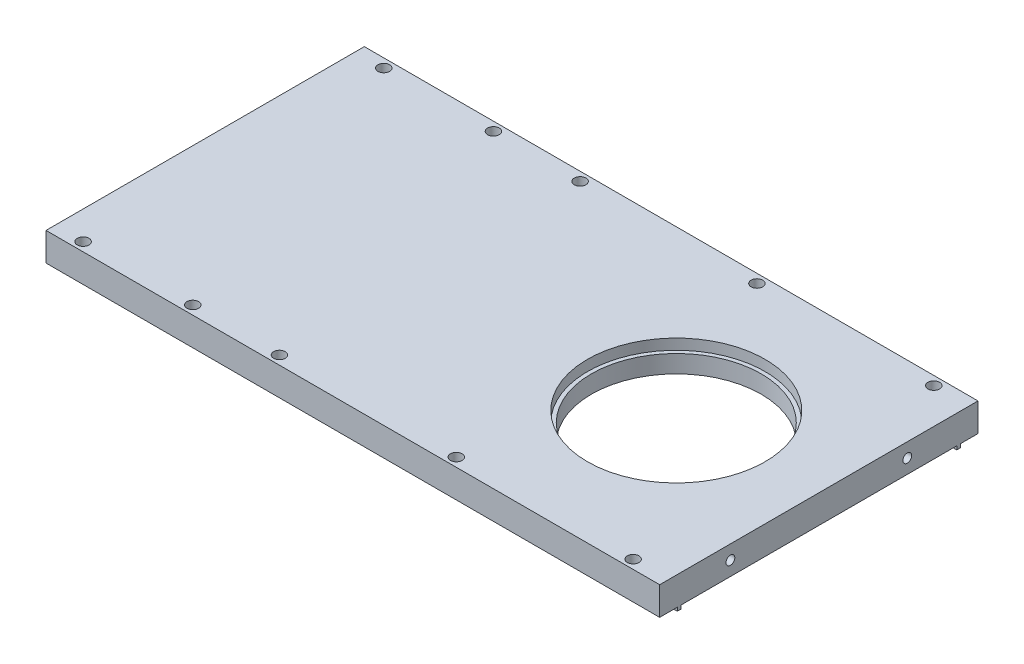
ISO-10303-21;
HEADER;
FILE_DESCRIPTION(('STEP AP214'),'2;1');
FILE_NAME('part.step','',(''),(''),'','','');
FILE_SCHEMA(('AUTOMOTIVE_DESIGN { 1 0 10303 214 1 1 1 1 }'));
ENDSEC;
DATA;
#1=APPLICATION_CONTEXT('core data for automotive mechanical design processes');
#2=APPLICATION_PROTOCOL_DEFINITION('international standard','automotive_design',2000,#1);
#3=PRODUCT_CONTEXT('',#1,'mechanical');
#4=PRODUCT('Part','Part','',(#3));
#5=PRODUCT_RELATED_PRODUCT_CATEGORY('part','',(#4));
#6=PRODUCT_DEFINITION_FORMATION('','',#4);
#7=PRODUCT_DEFINITION_CONTEXT('part definition',#1,'design');
#8=PRODUCT_DEFINITION('design','',#6,#7);
#9=PRODUCT_DEFINITION_SHAPE('','',#8);
#10=(LENGTH_UNIT() NAMED_UNIT(*) SI_UNIT(.MILLI.,.METRE.));
#11=(NAMED_UNIT(*) PLANE_ANGLE_UNIT() SI_UNIT($,.RADIAN.));
#12=(NAMED_UNIT(*) SI_UNIT($,.STERADIAN.) SOLID_ANGLE_UNIT());
#13=UNCERTAINTY_MEASURE_WITH_UNIT(LENGTH_MEASURE(1.E-05),#10,'distance_accuracy_value','');
#14=(GEOMETRIC_REPRESENTATION_CONTEXT(3) GLOBAL_UNCERTAINTY_ASSIGNED_CONTEXT((#13)) GLOBAL_UNIT_ASSIGNED_CONTEXT((#10,
#11,#12)) REPRESENTATION_CONTEXT('',''));
#15=CARTESIAN_POINT('',(0.,0.,0.));
#16=DIRECTION('',(0.,0.,1.));
#17=DIRECTION('',(1.,0.,0.));
#18=AXIS2_PLACEMENT_3D('',#15,#16,#17);
#19=CARTESIAN_POINT('',(217.,-22.,90.));
#20=DIRECTION('',(0.,1.,0.));
#21=DIRECTION('',(-1.,0.,0.));
#22=AXIS2_PLACEMENT_3D('',#19,#20,#21);
#23=PLANE('',#22);
#24=CARTESIAN_POINT('',(157.,-22.,2.5));
#25=DIRECTION('',(0.,1.,0.));
#26=DIRECTION('',(-1.,0.,0.));
#27=AXIS2_PLACEMENT_3D('',#24,#25,#26);
#28=CIRCLE('',#27,1.65000000000002);
#29=CARTESIAN_POINT('',(155.35,-22.,2.5));
#30=VERTEX_POINT('',#29);
#31=EDGE_CURVE('E218',#30,#30,#28,.T.);
#32=ORIENTED_EDGE('',*,*,#31,.T.);
#33=EDGE_LOOP('',(#32));
#34=FACE_BOUND('',#33,.T.);
#35=CARTESIAN_POINT('',(107.,-22.,2.5));
#36=DIRECTION('',(0.,1.,0.));
#37=DIRECTION('',(-1.,0.,0.));
#38=AXIS2_PLACEMENT_3D('',#35,#36,#37);
#39=CIRCLE('',#38,1.65);
#40=CARTESIAN_POINT('',(105.35,-22.,2.5));
#41=VERTEX_POINT('',#40);
#42=EDGE_CURVE('E215',#41,#41,#39,.T.);
#43=ORIENTED_EDGE('',*,*,#42,.T.);
#44=EDGE_LOOP('',(#43));
#45=FACE_BOUND('',#44,.T.);
#46=CARTESIAN_POINT('',(207.,-22.,87.5));
#47=DIRECTION('',(0.,1.,0.));
#48=DIRECTION('',(-1.,0.,0.));
#49=AXIS2_PLACEMENT_3D('',#46,#47,#48);
#50=CIRCLE('',#49,1.65000000000002);
#51=CARTESIAN_POINT('',(205.35,-22.,87.5));
#52=VERTEX_POINT('',#51);
#53=EDGE_CURVE('E212',#52,#52,#50,.T.);
#54=ORIENTED_EDGE('',*,*,#53,.T.);
#55=EDGE_LOOP('',(#54));
#56=FACE_BOUND('',#55,.T.);
#57=CARTESIAN_POINT('',(157.,-22.,87.5));
#58=DIRECTION('',(0.,1.,0.));
#59=DIRECTION('',(-1.,0.,0.));
#60=AXIS2_PLACEMENT_3D('',#57,#58,#59);
#61=CIRCLE('',#60,1.65000000000002);
#62=CARTESIAN_POINT('',(155.35,-22.,87.5));
#63=VERTEX_POINT('',#62);
#64=EDGE_CURVE('E208',#63,#63,#61,.T.);
#65=ORIENTED_EDGE('',*,*,#64,.T.);
#66=EDGE_LOOP('',(#65));
#67=FACE_BOUND('',#66,.T.);
#68=CARTESIAN_POINT('',(82.5,-22.,2.5));
#69=DIRECTION('',(0.,1.,0.));
#70=DIRECTION('',(-1.,0.,0.));
#71=AXIS2_PLACEMENT_3D('',#68,#69,#70);
#72=CIRCLE('',#71,1.65);
#73=CARTESIAN_POINT('',(80.85,-22.,2.5));
#74=VERTEX_POINT('',#73);
#75=EDGE_CURVE('E204',#74,#74,#72,.T.);
#76=ORIENTED_EDGE('',*,*,#75,.T.);
#77=EDGE_LOOP('',(#76));
#78=FACE_BOUND('',#77,.T.);
#79=CARTESIAN_POINT('',(51.5,-22.,87.5));
#80=DIRECTION('',(0.,1.,0.));
#81=DIRECTION('',(-1.,0.,0.));
#82=AXIS2_PLACEMENT_3D('',#79,#80,#81);
#83=CIRCLE('',#82,1.65);
#84=CARTESIAN_POINT('',(49.85,-22.,87.5));
#85=VERTEX_POINT('',#84);
#86=EDGE_CURVE('E233',#85,#85,#83,.T.);
#87=ORIENTED_EDGE('',*,*,#86,.T.);
#88=EDGE_LOOP('',(#87));
#89=FACE_BOUND('',#88,.T.);
#90=CARTESIAN_POINT('',(82.5,-22.,87.5));
#91=DIRECTION('',(0.,1.,0.));
#92=DIRECTION('',(-1.,0.,0.));
#93=AXIS2_PLACEMENT_3D('',#90,#91,#92);
#94=CIRCLE('',#93,1.65);
#95=CARTESIAN_POINT('',(80.85,-22.,87.5));
#96=VERTEX_POINT('',#95);
#97=EDGE_CURVE('E200',#96,#96,#94,.T.);
#98=ORIENTED_EDGE('',*,*,#97,.T.);
#99=EDGE_LOOP('',(#98));
#100=FACE_BOUND('',#99,.T.);
#101=CARTESIAN_POINT('',(107.,-22.,87.5));
#102=DIRECTION('',(0.,1.,0.));
#103=DIRECTION('',(-1.,0.,0.));
#104=AXIS2_PLACEMENT_3D('',#101,#102,#103);
#105=CIRCLE('',#104,1.65);
#106=CARTESIAN_POINT('',(105.35,-22.,87.5));
#107=VERTEX_POINT('',#106);
#108=EDGE_CURVE('E196',#107,#107,#105,.T.);
#109=ORIENTED_EDGE('',*,*,#108,.T.);
#110=EDGE_LOOP('',(#109));
#111=FACE_BOUND('',#110,.T.);
#112=CARTESIAN_POINT('',(207.,-22.,2.5));
#113=DIRECTION('',(0.,1.,0.));
#114=DIRECTION('',(-1.,0.,0.));
#115=AXIS2_PLACEMENT_3D('',#112,#113,#114);
#116=CIRCLE('',#115,1.65000000000002);
#117=CARTESIAN_POINT('',(205.35,-22.,2.5));
#118=VERTEX_POINT('',#117);
#119=EDGE_CURVE('E191',#118,#118,#116,.T.);
#120=ORIENTED_EDGE('',*,*,#119,.T.);
#121=EDGE_LOOP('',(#120));
#122=FACE_BOUND('',#121,.T.);
#123=CARTESIAN_POINT('',(51.5,-22.,2.5));
#124=DIRECTION('',(0.,1.,0.));
#125=DIRECTION('',(-1.,0.,0.));
#126=AXIS2_PLACEMENT_3D('',#123,#124,#125);
#127=CIRCLE('',#126,1.65);
#128=CARTESIAN_POINT('',(49.85,-22.,2.5));
#129=VERTEX_POINT('',#128);
#130=EDGE_CURVE('E222',#129,#129,#127,.T.);
#131=ORIENTED_EDGE('',*,*,#130,.T.);
#132=EDGE_LOOP('',(#131));
#133=FACE_BOUND('',#132,.T.);
#134=CARTESIAN_POINT('',(176.7,-22.,45.));
#135=DIRECTION('',(0.,1.,0.));
#136=DIRECTION('',(0.,0.,1.));
#137=AXIS2_PLACEMENT_3D('',#134,#135,#136);
#138=CIRCLE('',#137,24.);
#139=CARTESIAN_POINT('',(176.7,-22.,68.9999999999999));
#140=VERTEX_POINT('',#139);
#141=EDGE_CURVE('E169',#140,#140,#138,.T.);
#142=ORIENTED_EDGE('',*,*,#141,.T.);
#143=EDGE_LOOP('',(#142));
#144=FACE_BOUND('',#143,.T.);
#145=DIRECTION('',(1.,0.,0.));
#146=VECTOR('',#145,1.);
#147=CARTESIAN_POINT('',(73.5,-22.,5.));
#148=LINE('',#147,#146);
#149=CARTESIAN_POINT('',(73.5,-22.,5.));
#150=VERTEX_POINT('',#149);
#151=CARTESIAN_POINT('',(217.,-22.,5.00000000000003));
#152=VERTEX_POINT('',#151);
#153=EDGE_CURVE('E250',#150,#152,#148,.T.);
#154=ORIENTED_EDGE('',*,*,#153,.F.);
#155=DIRECTION('',(0.,0.,-1.));
#156=VECTOR('',#155,1.);
#157=CARTESIAN_POINT('',(73.5,-22.,6.));
#158=LINE('',#157,#156);
#159=CARTESIAN_POINT('',(73.5,-22.,6.));
#160=VERTEX_POINT('',#159);
#161=EDGE_CURVE('E236',#160,#150,#158,.T.);
#162=ORIENTED_EDGE('',*,*,#161,.F.);
#163=DIRECTION('',(-1.,0.,0.));
#164=VECTOR('',#163,1.);
#165=CARTESIAN_POINT('',(73.5,-22.,6.));
#166=LINE('',#165,#164);
#167=CARTESIAN_POINT('',(217.,-22.,6.));
#168=VERTEX_POINT('',#167);
#169=EDGE_CURVE('E241',#168,#160,#166,.T.);
#170=ORIENTED_EDGE('',*,*,#169,.F.);
#171=DIRECTION('',(0.,0.,-1.));
#172=VECTOR('',#171,1.);
#173=CARTESIAN_POINT('',(217.,-22.,90.));
#174=LINE('',#173,#172);
#175=CARTESIAN_POINT('',(217.,-22.,84.));
#176=VERTEX_POINT('',#175);
#177=EDGE_CURVE('E182',#176,#168,#174,.T.);
#178=ORIENTED_EDGE('',*,*,#177,.F.);
#179=DIRECTION('',(1.,0.,0.));
#180=VECTOR('',#179,1.);
#181=CARTESIAN_POINT('',(73.5,-22.,84.));
#182=LINE('',#181,#180);
#183=CARTESIAN_POINT('',(73.5,-22.,84.));
#184=VERTEX_POINT('',#183);
#185=EDGE_CURVE('E272',#184,#176,#182,.T.);
#186=ORIENTED_EDGE('',*,*,#185,.F.);
#187=DIRECTION('',(0.,0.,-1.));
#188=VECTOR('',#187,1.);
#189=CARTESIAN_POINT('',(73.5,-22.,84.));
#190=LINE('',#189,#188);
#191=CARTESIAN_POINT('',(73.5,-22.,85.));
#192=VERTEX_POINT('',#191);
#193=EDGE_CURVE('E66',#192,#184,#190,.T.);
#194=ORIENTED_EDGE('',*,*,#193,.F.);
#195=DIRECTION('',(-1.,0.,0.));
#196=VECTOR('',#195,1.);
#197=CARTESIAN_POINT('',(73.5,-22.,85.));
#198=LINE('',#197,#196);
#199=CARTESIAN_POINT('',(217.,-22.,85.));
#200=VERTEX_POINT('',#199);
#201=EDGE_CURVE('E264',#200,#192,#198,.T.);
#202=ORIENTED_EDGE('',*,*,#201,.F.);
#203=CARTESIAN_POINT('',(217.,-22.,90.));
#204=VERTEX_POINT('',#203);
#205=EDGE_CURVE('E50',#204,#200,#174,.T.);
#206=ORIENTED_EDGE('',*,*,#205,.F.);
#207=DIRECTION('',(1.,0.,0.));
#208=VECTOR('',#207,1.);
#209=CARTESIAN_POINT('',(217.,-22.,90.));
#210=LINE('',#209,#208);
#211=CARTESIAN_POINT('',(43.5,-22.,90.));
#212=VERTEX_POINT('',#211);
#213=EDGE_CURVE('E163',#212,#204,#210,.T.);
#214=ORIENTED_EDGE('',*,*,#213,.F.);
#215=DIRECTION('',(0.,0.,-1.));
#216=VECTOR('',#215,1.);
#217=CARTESIAN_POINT('',(43.5,-22.,90.));
#218=LINE('',#217,#216);
#219=CARTESIAN_POINT('',(43.5,-22.,0.));
#220=VERTEX_POINT('',#219);
#221=EDGE_CURVE('E11',#212,#220,#218,.T.);
#222=ORIENTED_EDGE('',*,*,#221,.T.);
#223=DIRECTION('',(1.,0.,0.));
#224=VECTOR('',#223,1.);
#225=CARTESIAN_POINT('',(217.,-22.,0.));
#226=LINE('',#225,#224);
#227=CARTESIAN_POINT('',(217.,-22.,0.));
#228=VERTEX_POINT('',#227);
#229=EDGE_CURVE('E175',#220,#228,#226,.T.);
#230=ORIENTED_EDGE('',*,*,#229,.T.);
#231=EDGE_CURVE('E180',#152,#228,#174,.T.);
#232=ORIENTED_EDGE('',*,*,#231,.F.);
#233=EDGE_LOOP('',(#154,#162,#170,#178,#186,#194,#202,#206,#214,#222,#230,#232));
#234=FACE_BOUND('',#233,.T.);
#235=ADVANCED_FACE('F41',(#34,#45,#56,#67,#78,#89,#100,#111,#122,#133,#144,#234),#23,.F.);
#236=CARTESIAN_POINT('',(176.7,-22.,45.));
#237=DIRECTION('',(0.,1.,0.));
#238=DIRECTION('',(0.,0.,1.));
#239=AXIS2_PLACEMENT_3D('',#236,#237,#238);
#240=CYLINDRICAL_SURFACE('',#239,24.);
#241=ORIENTED_EDGE('',*,*,#141,.F.);
#242=EDGE_LOOP('',(#241));
#243=FACE_BOUND('',#242,.T.);
#244=CARTESIAN_POINT('',(176.7,-17.,45.));
#245=DIRECTION('',(0.,1.,0.));
#246=DIRECTION('',(0.,0.,1.));
#247=AXIS2_PLACEMENT_3D('',#244,#245,#246);
#248=CIRCLE('',#247,24.);
#249=CARTESIAN_POINT('',(176.7,-17.,68.9999999999999));
#250=VERTEX_POINT('',#249);
#251=EDGE_CURVE('E184',#250,#250,#248,.F.);
#252=ORIENTED_EDGE('',*,*,#251,.F.);
#253=EDGE_LOOP('',(#252));
#254=FACE_BOUND('',#253,.T.);
#255=ADVANCED_FACE('F308',(#243,#254),#240,.F.);
#256=CARTESIAN_POINT('',(43.5,-22.,90.));
#257=DIRECTION('',(1.,0.,0.));
#258=DIRECTION('',(0.,0.,-1.));
#259=AXIS2_PLACEMENT_3D('',#256,#257,#258);
#260=PLANE('',#259);
#261=DIRECTION('',(0.,-1.,0.));
#262=VECTOR('',#261,1.);
#263=CARTESIAN_POINT('',(43.5,-22.,90.));
#264=LINE('',#263,#262);
#265=CARTESIAN_POINT('',(43.5,-14.,90.));
#266=VERTEX_POINT('',#265);
#267=EDGE_CURVE('E142',#266,#212,#264,.T.);
#268=ORIENTED_EDGE('',*,*,#267,.F.);
#269=DIRECTION('',(0.,0.,-1.));
#270=VECTOR('',#269,1.);
#271=CARTESIAN_POINT('',(43.5,-14.,90.));
#272=LINE('',#271,#270);
#273=CARTESIAN_POINT('',(43.5,-14.,0.));
#274=VERTEX_POINT('',#273);
#275=EDGE_CURVE('E152',#266,#274,#272,.T.);
#276=ORIENTED_EDGE('',*,*,#275,.T.);
#277=DIRECTION('',(0.,-1.,0.));
#278=VECTOR('',#277,1.);
#279=CARTESIAN_POINT('',(43.5,-22.,0.));
#280=LINE('',#279,#278);
#281=EDGE_CURVE('E173',#274,#220,#280,.T.);
#282=ORIENTED_EDGE('',*,*,#281,.T.);
#283=ORIENTED_EDGE('',*,*,#221,.F.);
#284=EDGE_LOOP('',(#268,#276,#282,#283));
#285=FACE_BOUND('',#284,.T.);
#286=ADVANCED_FACE('F43',(#285),#260,.F.);
#287=CARTESIAN_POINT('',(217.,-14.,90.));
#288=DIRECTION('',(-1.,0.,0.));
#289=DIRECTION('',(0.,0.,1.));
#290=AXIS2_PLACEMENT_3D('',#287,#288,#289);
#291=PLANE('',#290);
#292=CARTESIAN_POINT('',(217.,-18.,70.));
#293=DIRECTION('',(1.,0.,0.));
#294=DIRECTION('',(0.,0.,-1.));
#295=AXIS2_PLACEMENT_3D('',#292,#293,#294);
#296=CIRCLE('',#295,1.24999999999999);
#297=CARTESIAN_POINT('',(217.,-18.,68.75));
#298=VERTEX_POINT('',#297);
#299=EDGE_CURVE('E159',#298,#298,#296,.T.);
#300=ORIENTED_EDGE('',*,*,#299,.F.);
#301=EDGE_LOOP('',(#300));
#302=FACE_BOUND('',#301,.T.);
#303=CARTESIAN_POINT('',(217.,-18.,20.));
#304=DIRECTION('',(1.,0.,0.));
#305=DIRECTION('',(0.,0.,-1.));
#306=AXIS2_PLACEMENT_3D('',#303,#304,#305);
#307=CIRCLE('',#306,1.24999999999999);
#308=CARTESIAN_POINT('',(217.,-18.,18.75));
#309=VERTEX_POINT('',#308);
#310=EDGE_CURVE('E463',#309,#309,#307,.T.);
#311=ORIENTED_EDGE('',*,*,#310,.F.);
#312=EDGE_LOOP('',(#311));
#313=FACE_BOUND('',#312,.T.);
#314=DIRECTION('',(0.,1.,0.));
#315=VECTOR('',#314,1.);
#316=CARTESIAN_POINT('',(217.,-14.,0.));
#317=LINE('',#316,#315);
#318=CARTESIAN_POINT('',(217.,-14.,0.));
#319=VERTEX_POINT('',#318);
#320=EDGE_CURVE('E166',#228,#319,#317,.T.);
#321=ORIENTED_EDGE('',*,*,#320,.T.);
#322=DIRECTION('',(0.,0.,-1.));
#323=VECTOR('',#322,1.);
#324=CARTESIAN_POINT('',(217.,-14.,90.));
#325=LINE('',#324,#323);
#326=CARTESIAN_POINT('',(217.,-14.,90.));
#327=VERTEX_POINT('',#326);
#328=EDGE_CURVE('E149',#327,#319,#325,.T.);
#329=ORIENTED_EDGE('',*,*,#328,.F.);
#330=DIRECTION('',(0.,1.,0.));
#331=VECTOR('',#330,1.);
#332=CARTESIAN_POINT('',(217.,-14.,90.));
#333=LINE('',#332,#331);
#334=EDGE_CURVE('E145',#204,#327,#333,.T.);
#335=ORIENTED_EDGE('',*,*,#334,.F.);
#336=ORIENTED_EDGE('',*,*,#205,.T.);
#337=DIRECTION('',(0.,1.,0.));
#338=VECTOR('',#337,1.);
#339=CARTESIAN_POINT('',(217.,-23.,85.));
#340=LINE('',#339,#338);
#341=CARTESIAN_POINT('',(217.,-23.,85.));
#342=VERTEX_POINT('',#341);
#343=EDGE_CURVE('E278',#342,#200,#340,.T.);
#344=ORIENTED_EDGE('',*,*,#343,.F.);
#345=DIRECTION('',(0.,0.,1.));
#346=VECTOR('',#345,1.);
#347=CARTESIAN_POINT('',(217.,-23.,84.));
#348=LINE('',#347,#346);
#349=CARTESIAN_POINT('',(217.,-23.,84.));
#350=VERTEX_POINT('',#349);
#351=EDGE_CURVE('E266',#350,#342,#348,.T.);
#352=ORIENTED_EDGE('',*,*,#351,.F.);
#353=DIRECTION('',(0.,1.,0.));
#354=VECTOR('',#353,1.);
#355=CARTESIAN_POINT('',(217.,-23.,84.));
#356=LINE('',#355,#354);
#357=EDGE_CURVE('E281',#350,#176,#356,.T.);
#358=ORIENTED_EDGE('',*,*,#357,.T.);
#359=ORIENTED_EDGE('',*,*,#177,.T.);
#360=DIRECTION('',(0.,1.,0.));
#361=VECTOR('',#360,1.);
#362=CARTESIAN_POINT('',(217.,-23.,6.));
#363=LINE('',#362,#361);
#364=CARTESIAN_POINT('',(217.,-23.,6.));
#365=VERTEX_POINT('',#364);
#366=EDGE_CURVE('E255',#365,#168,#363,.T.);
#367=ORIENTED_EDGE('',*,*,#366,.F.);
#368=DIRECTION('',(0.,0.,1.));
#369=VECTOR('',#368,1.);
#370=CARTESIAN_POINT('',(217.,-23.,6.));
#371=LINE('',#370,#369);
#372=CARTESIAN_POINT('',(217.,-23.,5.));
#373=VERTEX_POINT('',#372);
#374=EDGE_CURVE('E243',#373,#365,#371,.T.);
#375=ORIENTED_EDGE('',*,*,#374,.F.);
#376=DIRECTION('',(0.,1.,0.));
#377=VECTOR('',#376,1.);
#378=CARTESIAN_POINT('',(217.,-23.,5.));
#379=LINE('',#378,#377);
#380=EDGE_CURVE('E58',#373,#152,#379,.T.);
#381=ORIENTED_EDGE('',*,*,#380,.T.);
#382=ORIENTED_EDGE('',*,*,#231,.T.);
#383=EDGE_LOOP('',(#321,#329,#335,#336,#344,#352,#358,#359,#367,#375,#381,#382));
#384=FACE_BOUND('',#383,.T.);
#385=ADVANCED_FACE('F295',(#302,#313,#384),#291,.F.);
#386=CARTESIAN_POINT('',(53.5,-14.,90.));
#387=DIRECTION('',(0.,-1.,0.));
#388=DIRECTION('',(1.,0.,0.));
#389=AXIS2_PLACEMENT_3D('',#386,#387,#388);
#390=PLANE('',#389);
#391=CARTESIAN_POINT('',(157.,-14.,2.5));
#392=DIRECTION('',(0.,-1.,0.));
#393=DIRECTION('',(1.,0.,0.));
#394=AXIS2_PLACEMENT_3D('',#391,#392,#393);
#395=CIRCLE('',#394,1.65000000000002);
#396=CARTESIAN_POINT('',(158.65,-14.,2.5));
#397=VERTEX_POINT('',#396);
#398=EDGE_CURVE('E216',#397,#397,#395,.T.);
#399=ORIENTED_EDGE('',*,*,#398,.T.);
#400=EDGE_LOOP('',(#399));
#401=FACE_BOUND('',#400,.T.);
#402=CARTESIAN_POINT('',(107.,-14.,2.5));
#403=DIRECTION('',(0.,-1.,0.));
#404=DIRECTION('',(1.,0.,0.));
#405=AXIS2_PLACEMENT_3D('',#402,#403,#404);
#406=CIRCLE('',#405,1.65);
#407=CARTESIAN_POINT('',(108.65,-14.,2.5));
#408=VERTEX_POINT('',#407);
#409=EDGE_CURVE('E213',#408,#408,#406,.T.);
#410=ORIENTED_EDGE('',*,*,#409,.T.);
#411=EDGE_LOOP('',(#410));
#412=FACE_BOUND('',#411,.T.);
#413=CARTESIAN_POINT('',(207.,-14.,87.5));
#414=DIRECTION('',(0.,-1.,0.));
#415=DIRECTION('',(1.,0.,0.));
#416=AXIS2_PLACEMENT_3D('',#413,#414,#415);
#417=CIRCLE('',#416,1.65000000000002);
#418=CARTESIAN_POINT('',(208.65,-14.,87.5));
#419=VERTEX_POINT('',#418);
#420=EDGE_CURVE('E209',#419,#419,#417,.T.);
#421=ORIENTED_EDGE('',*,*,#420,.T.);
#422=EDGE_LOOP('',(#421));
#423=FACE_BOUND('',#422,.T.);
#424=CARTESIAN_POINT('',(157.,-14.,87.5));
#425=DIRECTION('',(0.,-1.,0.));
#426=DIRECTION('',(1.,0.,0.));
#427=AXIS2_PLACEMENT_3D('',#424,#425,#426);
#428=CIRCLE('',#427,1.65000000000002);
#429=CARTESIAN_POINT('',(158.65,-14.,87.5));
#430=VERTEX_POINT('',#429);
#431=EDGE_CURVE('E205',#430,#430,#428,.T.);
#432=ORIENTED_EDGE('',*,*,#431,.T.);
#433=EDGE_LOOP('',(#432));
#434=FACE_BOUND('',#433,.T.);
#435=CARTESIAN_POINT('',(82.5,-14.,2.5));
#436=DIRECTION('',(0.,-1.,0.));
#437=DIRECTION('',(1.,0.,0.));
#438=AXIS2_PLACEMENT_3D('',#435,#436,#437);
#439=CIRCLE('',#438,1.65);
#440=CARTESIAN_POINT('',(84.15,-14.,2.5));
#441=VERTEX_POINT('',#440);
#442=EDGE_CURVE('E201',#441,#441,#439,.T.);
#443=ORIENTED_EDGE('',*,*,#442,.T.);
#444=EDGE_LOOP('',(#443));
#445=FACE_BOUND('',#444,.T.);
#446=CARTESIAN_POINT('',(82.5,-14.,87.5));
#447=DIRECTION('',(0.,-1.,0.));
#448=DIRECTION('',(1.,0.,0.));
#449=AXIS2_PLACEMENT_3D('',#446,#447,#448);
#450=CIRCLE('',#449,1.65);
#451=CARTESIAN_POINT('',(84.15,-14.,87.5));
#452=VERTEX_POINT('',#451);
#453=EDGE_CURVE('E197',#452,#452,#450,.T.);
#454=ORIENTED_EDGE('',*,*,#453,.T.);
#455=EDGE_LOOP('',(#454));
#456=FACE_BOUND('',#455,.T.);
#457=CARTESIAN_POINT('',(107.,-14.,87.5));
#458=DIRECTION('',(0.,-1.,0.));
#459=DIRECTION('',(1.,0.,0.));
#460=AXIS2_PLACEMENT_3D('',#457,#458,#459);
#461=CIRCLE('',#460,1.65);
#462=CARTESIAN_POINT('',(108.65,-14.,87.5));
#463=VERTEX_POINT('',#462);
#464=EDGE_CURVE('E193',#463,#463,#461,.T.);
#465=ORIENTED_EDGE('',*,*,#464,.T.);
#466=EDGE_LOOP('',(#465));
#467=FACE_BOUND('',#466,.T.);
#468=CARTESIAN_POINT('',(207.,-14.,2.5));
#469=DIRECTION('',(0.,-1.,0.));
#470=DIRECTION('',(1.,0.,0.));
#471=AXIS2_PLACEMENT_3D('',#468,#469,#470);
#472=CIRCLE('',#471,1.65000000000002);
#473=CARTESIAN_POINT('',(208.65,-14.,2.5));
#474=VERTEX_POINT('',#473);
#475=EDGE_CURVE('E188',#474,#474,#472,.T.);
#476=ORIENTED_EDGE('',*,*,#475,.T.);
#477=EDGE_LOOP('',(#476));
#478=FACE_BOUND('',#477,.T.);
#479=CARTESIAN_POINT('',(176.7,-14.,45.));
#480=DIRECTION('',(0.,1.,0.));
#481=DIRECTION('',(0.,0.,1.));
#482=AXIS2_PLACEMENT_3D('',#479,#480,#481);
#483=CIRCLE('',#482,25.1);
#484=CARTESIAN_POINT('',(176.7,-14.,70.1));
#485=VERTEX_POINT('',#484);
#486=EDGE_CURVE('E287',#485,#485,#483,.T.);
#487=ORIENTED_EDGE('',*,*,#486,.F.);
#488=EDGE_LOOP('',(#487));
#489=FACE_BOUND('',#488,.T.);
#490=DIRECTION('',(-1.,0.,0.));
#491=VECTOR('',#490,1.);
#492=CARTESIAN_POINT('',(53.5,-14.,0.));
#493=LINE('',#492,#491);
#494=EDGE_CURVE('E156',#319,#274,#493,.T.);
#495=ORIENTED_EDGE('',*,*,#494,.T.);
#496=ORIENTED_EDGE('',*,*,#275,.F.);
#497=DIRECTION('',(-1.,0.,0.));
#498=VECTOR('',#497,1.);
#499=CARTESIAN_POINT('',(53.5,-14.,90.));
#500=LINE('',#499,#498);
#501=EDGE_CURVE('E138',#327,#266,#500,.T.);
#502=ORIENTED_EDGE('',*,*,#501,.F.);
#503=ORIENTED_EDGE('',*,*,#328,.T.);
#504=EDGE_LOOP('',(#495,#496,#502,#503));
#505=FACE_BOUND('',#504,.T.);
#506=CARTESIAN_POINT('',(51.5,-14.,87.5));
#507=DIRECTION('',(0.,-1.,0.));
#508=DIRECTION('',(0.,0.,-1.));
#509=AXIS2_PLACEMENT_3D('',#506,#507,#508);
#510=CIRCLE('',#509,1.65);
#511=CARTESIAN_POINT('',(51.5,-14.,85.85));
#512=VERTEX_POINT('',#511);
#513=EDGE_CURVE('E45',#512,#512,#510,.F.);
#514=ORIENTED_EDGE('',*,*,#513,.F.);
#515=EDGE_LOOP('',(#514));
#516=FACE_BOUND('',#515,.T.);
#517=CARTESIAN_POINT('',(51.5,-14.,2.5));
#518=DIRECTION('',(0.,-1.,0.));
#519=DIRECTION('',(0.,0.,-1.));
#520=AXIS2_PLACEMENT_3D('',#517,#518,#519);
#521=CIRCLE('',#520,1.65);
#522=CARTESIAN_POINT('',(51.5,-14.,0.85));
#523=VERTEX_POINT('',#522);
#524=EDGE_CURVE('E160',#523,#523,#521,.F.);
#525=ORIENTED_EDGE('',*,*,#524,.F.);
#526=EDGE_LOOP('',(#525));
#527=FACE_BOUND('',#526,.T.);
#528=ADVANCED_FACE('F153',(#401,#412,#423,#434,#445,#456,#467,#478,#489,#505,#516,#527),#390,.F.);
#529=CARTESIAN_POINT('',(0.,0.,90.));
#530=DIRECTION('',(0.,0.,-1.));
#531=DIRECTION('',(-1.,0.,0.));
#532=AXIS2_PLACEMENT_3D('',#529,#530,#531);
#533=PLANE('',#532);
#534=ORIENTED_EDGE('',*,*,#501,.T.);
#535=ORIENTED_EDGE('',*,*,#267,.T.);
#536=ORIENTED_EDGE('',*,*,#213,.T.);
#537=ORIENTED_EDGE('',*,*,#334,.T.);
#538=EDGE_LOOP('',(#534,#535,#536,#537));
#539=FACE_BOUND('',#538,.T.);
#540=ADVANCED_FACE('F140',(#539),#533,.F.);
#541=CARTESIAN_POINT('',(0.,0.,0.));
#542=DIRECTION('',(0.,0.,-1.));
#543=DIRECTION('',(-1.,0.,0.));
#544=AXIS2_PLACEMENT_3D('',#541,#542,#543);
#545=PLANE('',#544);
#546=ORIENTED_EDGE('',*,*,#281,.F.);
#547=ORIENTED_EDGE('',*,*,#494,.F.);
#548=ORIENTED_EDGE('',*,*,#320,.F.);
#549=ORIENTED_EDGE('',*,*,#229,.F.);
#550=EDGE_LOOP('',(#546,#547,#548,#549));
#551=FACE_BOUND('',#550,.T.);
#552=ADVANCED_FACE('F301',(#551),#545,.T.);
#553=CARTESIAN_POINT('',(176.7,-17.,45.));
#554=DIRECTION('',(0.,1.,0.));
#555=DIRECTION('',(0.,0.,1.));
#556=AXIS2_PLACEMENT_3D('',#553,#554,#555);
#557=PLANE('',#556);
#558=CARTESIAN_POINT('',(176.7,-17.,45.));
#559=DIRECTION('',(0.,1.,0.));
#560=DIRECTION('',(0.,0.,1.));
#561=AXIS2_PLACEMENT_3D('',#558,#559,#560);
#562=CIRCLE('',#561,25.1);
#563=CARTESIAN_POINT('',(176.7,-17.,70.1));
#564=VERTEX_POINT('',#563);
#565=EDGE_CURVE('E187',#564,#564,#562,.T.);
#566=ORIENTED_EDGE('',*,*,#565,.T.);
#567=EDGE_LOOP('',(#566));
#568=FACE_BOUND('',#567,.T.);
#569=ORIENTED_EDGE('',*,*,#251,.T.);
#570=EDGE_LOOP('',(#569));
#571=FACE_BOUND('',#570,.T.);
#572=ADVANCED_FACE('F363',(#568,#571),#557,.T.);
#573=CARTESIAN_POINT('',(176.7,-17.,45.));
#574=DIRECTION('',(0.,1.,0.));
#575=DIRECTION('',(0.,0.,1.));
#576=AXIS2_PLACEMENT_3D('',#573,#574,#575);
#577=CYLINDRICAL_SURFACE('',#576,25.1);
#578=ORIENTED_EDGE('',*,*,#565,.F.);
#579=EDGE_LOOP('',(#578));
#580=FACE_BOUND('',#579,.T.);
#581=ORIENTED_EDGE('',*,*,#486,.T.);
#582=EDGE_LOOP('',(#581));
#583=FACE_BOUND('',#582,.T.);
#584=ADVANCED_FACE('F292',(#580,#583),#577,.F.);
#585=CARTESIAN_POINT('',(73.5,-23.,84.));
#586=DIRECTION('',(1.,0.,0.));
#587=DIRECTION('',(0.,0.,-1.));
#588=AXIS2_PLACEMENT_3D('',#585,#586,#587);
#589=PLANE('',#588);
#590=ORIENTED_EDGE('',*,*,#193,.T.);
#591=DIRECTION('',(0.,1.,0.));
#592=VECTOR('',#591,1.);
#593=CARTESIAN_POINT('',(73.5,-23.,84.));
#594=LINE('',#593,#592);
#595=CARTESIAN_POINT('',(73.5,-23.,84.));
#596=VERTEX_POINT('',#595);
#597=EDGE_CURVE('E284',#596,#184,#594,.T.);
#598=ORIENTED_EDGE('',*,*,#597,.F.);
#599=DIRECTION('',(0.,0.,-1.));
#600=VECTOR('',#599,1.);
#601=CARTESIAN_POINT('',(73.5,-23.,84.));
#602=LINE('',#601,#600);
#603=CARTESIAN_POINT('',(73.5,-23.,85.));
#604=VERTEX_POINT('',#603);
#605=EDGE_CURVE('E260',#604,#596,#602,.T.);
#606=ORIENTED_EDGE('',*,*,#605,.F.);
#607=DIRECTION('',(0.,1.,0.));
#608=VECTOR('',#607,1.);
#609=CARTESIAN_POINT('',(73.5,-23.,85.));
#610=LINE('',#609,#608);
#611=EDGE_CURVE('E270',#604,#192,#610,.T.);
#612=ORIENTED_EDGE('',*,*,#611,.T.);
#613=EDGE_LOOP('',(#590,#598,#606,#612));
#614=FACE_BOUND('',#613,.T.);
#615=ADVANCED_FACE('F371',(#614),#589,.F.);
#616=CARTESIAN_POINT('',(73.5,-23.,84.));
#617=DIRECTION('',(0.,0.,1.));
#618=DIRECTION('',(1.,0.,0.));
#619=AXIS2_PLACEMENT_3D('',#616,#617,#618);
#620=PLANE('',#619);
#621=ORIENTED_EDGE('',*,*,#185,.T.);
#622=ORIENTED_EDGE('',*,*,#357,.F.);
#623=DIRECTION('',(1.,0.,0.));
#624=VECTOR('',#623,1.);
#625=CARTESIAN_POINT('',(73.5,-23.,84.));
#626=LINE('',#625,#624);
#627=EDGE_CURVE('E263',#596,#350,#626,.T.);
#628=ORIENTED_EDGE('',*,*,#627,.F.);
#629=ORIENTED_EDGE('',*,*,#597,.T.);
#630=EDGE_LOOP('',(#621,#622,#628,#629));
#631=FACE_BOUND('',#630,.T.);
#632=ADVANCED_FACE('F376',(#631),#620,.F.);
#633=CARTESIAN_POINT('',(73.5,-23.,85.));
#634=DIRECTION('',(0.,0.,-1.));
#635=DIRECTION('',(-1.,0.,0.));
#636=AXIS2_PLACEMENT_3D('',#633,#634,#635);
#637=PLANE('',#636);
#638=ORIENTED_EDGE('',*,*,#201,.T.);
#639=ORIENTED_EDGE('',*,*,#611,.F.);
#640=DIRECTION('',(-1.,0.,0.));
#641=VECTOR('',#640,1.);
#642=CARTESIAN_POINT('',(73.5,-23.,85.));
#643=LINE('',#642,#641);
#644=EDGE_CURVE('E268',#342,#604,#643,.T.);
#645=ORIENTED_EDGE('',*,*,#644,.F.);
#646=ORIENTED_EDGE('',*,*,#343,.T.);
#647=EDGE_LOOP('',(#638,#639,#645,#646));
#648=FACE_BOUND('',#647,.T.);
#649=ADVANCED_FACE('F380',(#648),#637,.F.);
#650=CARTESIAN_POINT('',(0.,-23.,0.));
#651=DIRECTION('',(0.,1.,0.));
#652=DIRECTION('',(-1.,0.,0.));
#653=AXIS2_PLACEMENT_3D('',#650,#651,#652);
#654=PLANE('',#653);
#655=ORIENTED_EDGE('',*,*,#605,.T.);
#656=ORIENTED_EDGE('',*,*,#627,.T.);
#657=ORIENTED_EDGE('',*,*,#351,.T.);
#658=ORIENTED_EDGE('',*,*,#644,.T.);
#659=EDGE_LOOP('',(#655,#656,#657,#658));
#660=FACE_BOUND('',#659,.T.);
#661=ADVANCED_FACE('F384',(#660),#654,.F.);
#662=CARTESIAN_POINT('',(73.5,-23.,6.));
#663=DIRECTION('',(1.,0.,0.));
#664=DIRECTION('',(0.,0.,-1.));
#665=AXIS2_PLACEMENT_3D('',#662,#663,#664);
#666=PLANE('',#665);
#667=ORIENTED_EDGE('',*,*,#161,.T.);
#668=DIRECTION('',(0.,1.,0.));
#669=VECTOR('',#668,1.);
#670=CARTESIAN_POINT('',(73.5,-23.,5.));
#671=LINE('',#670,#669);
#672=CARTESIAN_POINT('',(73.5,-23.,5.));
#673=VERTEX_POINT('',#672);
#674=EDGE_CURVE('E258',#673,#150,#671,.T.);
#675=ORIENTED_EDGE('',*,*,#674,.F.);
#676=DIRECTION('',(0.,0.,-1.));
#677=VECTOR('',#676,1.);
#678=CARTESIAN_POINT('',(73.5,-23.,6.));
#679=LINE('',#678,#677);
#680=CARTESIAN_POINT('',(73.5,-23.,6.));
#681=VERTEX_POINT('',#680);
#682=EDGE_CURVE('E237',#681,#673,#679,.T.);
#683=ORIENTED_EDGE('',*,*,#682,.F.);
#684=DIRECTION('',(0.,1.,0.));
#685=VECTOR('',#684,1.);
#686=CARTESIAN_POINT('',(73.5,-23.,6.));
#687=LINE('',#686,#685);
#688=EDGE_CURVE('E247',#681,#160,#687,.T.);
#689=ORIENTED_EDGE('',*,*,#688,.T.);
#690=EDGE_LOOP('',(#667,#675,#683,#689));
#691=FACE_BOUND('',#690,.T.);
#692=ADVANCED_FACE('F350',(#691),#666,.F.);
#693=CARTESIAN_POINT('',(73.5,-23.,5.));
#694=DIRECTION('',(0.,0.,1.));
#695=DIRECTION('',(1.,0.,0.));
#696=AXIS2_PLACEMENT_3D('',#693,#694,#695);
#697=PLANE('',#696);
#698=ORIENTED_EDGE('',*,*,#153,.T.);
#699=ORIENTED_EDGE('',*,*,#380,.F.);
#700=DIRECTION('',(1.,0.,0.));
#701=VECTOR('',#700,1.);
#702=CARTESIAN_POINT('',(73.5,-23.,5.));
#703=LINE('',#702,#701);
#704=EDGE_CURVE('E240',#673,#373,#703,.T.);
#705=ORIENTED_EDGE('',*,*,#704,.F.);
#706=ORIENTED_EDGE('',*,*,#674,.T.);
#707=EDGE_LOOP('',(#698,#699,#705,#706));
#708=FACE_BOUND('',#707,.T.);
#709=ADVANCED_FACE('F346',(#708),#697,.F.);
#710=CARTESIAN_POINT('',(73.5,-23.,6.));
#711=DIRECTION('',(0.,0.,-1.));
#712=DIRECTION('',(-1.,0.,0.));
#713=AXIS2_PLACEMENT_3D('',#710,#711,#712);
#714=PLANE('',#713);
#715=ORIENTED_EDGE('',*,*,#169,.T.);
#716=ORIENTED_EDGE('',*,*,#688,.F.);
#717=DIRECTION('',(-1.,0.,0.));
#718=VECTOR('',#717,1.);
#719=CARTESIAN_POINT('',(73.5,-23.,6.));
#720=LINE('',#719,#718);
#721=EDGE_CURVE('E245',#365,#681,#720,.T.);
#722=ORIENTED_EDGE('',*,*,#721,.F.);
#723=ORIENTED_EDGE('',*,*,#366,.T.);
#724=EDGE_LOOP('',(#715,#716,#722,#723));
#725=FACE_BOUND('',#724,.T.);
#726=ADVANCED_FACE('F354',(#725),#714,.F.);
#727=CARTESIAN_POINT('',(0.,-23.,0.));
#728=DIRECTION('',(0.,-1.,0.));
#729=DIRECTION('',(1.,0.,0.));
#730=AXIS2_PLACEMENT_3D('',#727,#728,#729);
#731=PLANE('',#730);
#732=ORIENTED_EDGE('',*,*,#682,.T.);
#733=ORIENTED_EDGE('',*,*,#704,.T.);
#734=ORIENTED_EDGE('',*,*,#374,.T.);
#735=ORIENTED_EDGE('',*,*,#721,.T.);
#736=EDGE_LOOP('',(#732,#733,#734,#735));
#737=FACE_BOUND('',#736,.T.);
#738=ADVANCED_FACE('F395',(#737),#731,.T.);
#739=CARTESIAN_POINT('',(207.,-23.,2.5));
#740=DIRECTION('',(0.,1.,0.));
#741=DIRECTION('',(-1.,0.,0.));
#742=AXIS2_PLACEMENT_3D('',#739,#740,#741);
#743=CYLINDRICAL_SURFACE('',#742,1.65000000000002);
#744=ORIENTED_EDGE('',*,*,#475,.F.);
#745=EDGE_LOOP('',(#744));
#746=FACE_BOUND('',#745,.T.);
#747=ORIENTED_EDGE('',*,*,#119,.F.);
#748=EDGE_LOOP('',(#747));
#749=FACE_BOUND('',#748,.T.);
#750=ADVANCED_FACE('F398',(#746,#749),#743,.F.);
#751=CARTESIAN_POINT('',(107.,-23.,87.5));
#752=DIRECTION('',(0.,1.,0.));
#753=DIRECTION('',(-1.,0.,0.));
#754=AXIS2_PLACEMENT_3D('',#751,#752,#753);
#755=CYLINDRICAL_SURFACE('',#754,1.65);
#756=ORIENTED_EDGE('',*,*,#464,.F.);
#757=EDGE_LOOP('',(#756));
#758=FACE_BOUND('',#757,.T.);
#759=ORIENTED_EDGE('',*,*,#108,.F.);
#760=EDGE_LOOP('',(#759));
#761=FACE_BOUND('',#760,.T.);
#762=ADVANCED_FACE('F416',(#758,#761),#755,.F.);
#763=CARTESIAN_POINT('',(82.5,-23.,87.5));
#764=DIRECTION('',(0.,1.,0.));
#765=DIRECTION('',(-1.,0.,0.));
#766=AXIS2_PLACEMENT_3D('',#763,#764,#765);
#767=CYLINDRICAL_SURFACE('',#766,1.65);
#768=ORIENTED_EDGE('',*,*,#453,.F.);
#769=EDGE_LOOP('',(#768));
#770=FACE_BOUND('',#769,.T.);
#771=ORIENTED_EDGE('',*,*,#97,.F.);
#772=EDGE_LOOP('',(#771));
#773=FACE_BOUND('',#772,.T.);
#774=ADVANCED_FACE('F414',(#770,#773),#767,.F.);
#775=CARTESIAN_POINT('',(82.5,-23.,2.5));
#776=DIRECTION('',(0.,1.,0.));
#777=DIRECTION('',(-1.,0.,0.));
#778=AXIS2_PLACEMENT_3D('',#775,#776,#777);
#779=CYLINDRICAL_SURFACE('',#778,1.65);
#780=ORIENTED_EDGE('',*,*,#442,.F.);
#781=EDGE_LOOP('',(#780));
#782=FACE_BOUND('',#781,.T.);
#783=ORIENTED_EDGE('',*,*,#75,.F.);
#784=EDGE_LOOP('',(#783));
#785=FACE_BOUND('',#784,.T.);
#786=ADVANCED_FACE('F410',(#782,#785),#779,.F.);
#787=CARTESIAN_POINT('',(157.,-23.,87.5));
#788=DIRECTION('',(0.,1.,0.));
#789=DIRECTION('',(-1.,0.,0.));
#790=AXIS2_PLACEMENT_3D('',#787,#788,#789);
#791=CYLINDRICAL_SURFACE('',#790,1.65000000000002);
#792=ORIENTED_EDGE('',*,*,#431,.F.);
#793=EDGE_LOOP('',(#792));
#794=FACE_BOUND('',#793,.T.);
#795=ORIENTED_EDGE('',*,*,#64,.F.);
#796=EDGE_LOOP('',(#795));
#797=FACE_BOUND('',#796,.T.);
#798=ADVANCED_FACE('F413',(#794,#797),#791,.F.);
#799=CARTESIAN_POINT('',(207.,-23.,87.5));
#800=DIRECTION('',(0.,1.,0.));
#801=DIRECTION('',(-1.,0.,0.));
#802=AXIS2_PLACEMENT_3D('',#799,#800,#801);
#803=CYLINDRICAL_SURFACE('',#802,1.65000000000002);
#804=ORIENTED_EDGE('',*,*,#420,.F.);
#805=EDGE_LOOP('',(#804));
#806=FACE_BOUND('',#805,.T.);
#807=ORIENTED_EDGE('',*,*,#53,.F.);
#808=EDGE_LOOP('',(#807));
#809=FACE_BOUND('',#808,.T.);
#810=ADVANCED_FACE('F429',(#806,#809),#803,.F.);
#811=CARTESIAN_POINT('',(107.,-23.,2.5));
#812=DIRECTION('',(0.,1.,0.));
#813=DIRECTION('',(-1.,0.,0.));
#814=AXIS2_PLACEMENT_3D('',#811,#812,#813);
#815=CYLINDRICAL_SURFACE('',#814,1.65);
#816=ORIENTED_EDGE('',*,*,#409,.F.);
#817=EDGE_LOOP('',(#816));
#818=FACE_BOUND('',#817,.T.);
#819=ORIENTED_EDGE('',*,*,#42,.F.);
#820=EDGE_LOOP('',(#819));
#821=FACE_BOUND('',#820,.T.);
#822=ADVANCED_FACE('F425',(#818,#821),#815,.F.);
#823=CARTESIAN_POINT('',(157.,-23.,2.5));
#824=DIRECTION('',(0.,1.,0.));
#825=DIRECTION('',(-1.,0.,0.));
#826=AXIS2_PLACEMENT_3D('',#823,#824,#825);
#827=CYLINDRICAL_SURFACE('',#826,1.65000000000002);
#828=ORIENTED_EDGE('',*,*,#398,.F.);
#829=EDGE_LOOP('',(#828));
#830=FACE_BOUND('',#829,.T.);
#831=ORIENTED_EDGE('',*,*,#31,.F.);
#832=EDGE_LOOP('',(#831));
#833=FACE_BOUND('',#832,.T.);
#834=ADVANCED_FACE('F404',(#830,#833),#827,.F.);
#835=CARTESIAN_POINT('',(51.5,-23.,2.5));
#836=DIRECTION('',(0.,1.,0.));
#837=DIRECTION('',(-1.,0.,0.));
#838=AXIS2_PLACEMENT_3D('',#835,#836,#837);
#839=CYLINDRICAL_SURFACE('',#838,1.65);
#840=ORIENTED_EDGE('',*,*,#524,.T.);
#841=EDGE_LOOP('',(#840));
#842=FACE_BOUND('',#841,.T.);
#843=ORIENTED_EDGE('',*,*,#130,.F.);
#844=EDGE_LOOP('',(#843));
#845=FACE_BOUND('',#844,.T.);
#846=ADVANCED_FACE('F400',(#842,#845),#839,.F.);
#847=CARTESIAN_POINT('',(51.5,-23.,87.5));
#848=DIRECTION('',(0.,1.,0.));
#849=DIRECTION('',(-1.,0.,0.));
#850=AXIS2_PLACEMENT_3D('',#847,#848,#849);
#851=CYLINDRICAL_SURFACE('',#850,1.65);
#852=ORIENTED_EDGE('',*,*,#513,.T.);
#853=EDGE_LOOP('',(#852));
#854=FACE_BOUND('',#853,.T.);
#855=ORIENTED_EDGE('',*,*,#86,.F.);
#856=EDGE_LOOP('',(#855));
#857=FACE_BOUND('',#856,.T.);
#858=ADVANCED_FACE('F403',(#854,#857),#851,.F.);
#859=CARTESIAN_POINT('',(208.5,-18.,20.));
#860=DIRECTION('',(1.,0.,0.));
#861=DIRECTION('',(0.,0.,-1.));
#862=AXIS2_PLACEMENT_3D('',#859,#860,#861);
#863=CONICAL_SURFACE('',#862,1.24999999999999,1.02974425867664);
#864=CARTESIAN_POINT('',(207.748924226216,-18.,20.));
#865=VERTEX_POINT('',#864);
#866=VERTEX_LOOP('',#865);
#867=FACE_BOUND('',#866,.T.);
#868=CARTESIAN_POINT('',(208.5,-18.,20.));
#869=DIRECTION('',(1.,0.,0.));
#870=DIRECTION('',(0.,0.,-1.));
#871=AXIS2_PLACEMENT_3D('',#868,#869,#870);
#872=CIRCLE('',#871,1.24999999999999);
#873=CARTESIAN_POINT('',(208.5,-18.,18.75));
#874=VERTEX_POINT('',#873);
#875=EDGE_CURVE('E192',#874,#874,#872,.T.);
#876=ORIENTED_EDGE('',*,*,#875,.T.);
#877=EDGE_LOOP('',(#876));
#878=FACE_BOUND('',#877,.T.);
#879=ADVANCED_FACE('F408',(#867,#878),#863,.F.);
#880=CARTESIAN_POINT('',(217.,-18.,20.));
#881=DIRECTION('',(1.,0.,0.));
#882=DIRECTION('',(0.,0.,-1.));
#883=AXIS2_PLACEMENT_3D('',#880,#881,#882);
#884=CYLINDRICAL_SURFACE('',#883,1.24999999999999);
#885=ORIENTED_EDGE('',*,*,#875,.F.);
#886=EDGE_LOOP('',(#885));
#887=FACE_BOUND('',#886,.T.);
#888=ORIENTED_EDGE('',*,*,#310,.T.);
#889=EDGE_LOOP('',(#888));
#890=FACE_BOUND('',#889,.T.);
#891=ADVANCED_FACE('F442',(#887,#890),#884,.F.);
#892=CARTESIAN_POINT('',(208.5,-18.,70.));
#893=DIRECTION('',(1.,0.,0.));
#894=DIRECTION('',(0.,0.,-1.));
#895=AXIS2_PLACEMENT_3D('',#892,#893,#894);
#896=CONICAL_SURFACE('',#895,1.24999999999999,1.02974425867664);
#897=CARTESIAN_POINT('',(207.748924226216,-18.,70.));
#898=VERTEX_POINT('',#897);
#899=VERTEX_LOOP('',#898);
#900=FACE_BOUND('',#899,.T.);
#901=CARTESIAN_POINT('',(208.5,-18.,70.));
#902=DIRECTION('',(1.,0.,0.));
#903=DIRECTION('',(0.,0.,-1.));
#904=AXIS2_PLACEMENT_3D('',#901,#902,#903);
#905=CIRCLE('',#904,1.24999999999999);
#906=CARTESIAN_POINT('',(208.5,-18.,68.75));
#907=VERTEX_POINT('',#906);
#908=EDGE_CURVE('E459',#907,#907,#905,.T.);
#909=ORIENTED_EDGE('',*,*,#908,.T.);
#910=EDGE_LOOP('',(#909));
#911=FACE_BOUND('',#910,.T.);
#912=ADVANCED_FACE('F446',(#900,#911),#896,.F.);
#913=CARTESIAN_POINT('',(217.,-18.,70.));
#914=DIRECTION('',(1.,0.,0.));
#915=DIRECTION('',(0.,0.,-1.));
#916=AXIS2_PLACEMENT_3D('',#913,#914,#915);
#917=CYLINDRICAL_SURFACE('',#916,1.24999999999999);
#918=ORIENTED_EDGE('',*,*,#908,.F.);
#919=EDGE_LOOP('',(#918));
#920=FACE_BOUND('',#919,.T.);
#921=ORIENTED_EDGE('',*,*,#299,.T.);
#922=EDGE_LOOP('',(#921));
#923=FACE_BOUND('',#922,.T.);
#924=ADVANCED_FACE('F450',(#920,#923),#917,.F.);
#925=CLOSED_SHELL('',(#235,#255,#286,#385,#528,#540,#552,#572,#584,#615,#632,#649,#661,#692,
#709,#726,#738,#750,#762,#774,#786,#798,#810,#822,#834,#846,#858,#879,#891,#912,#924));
#926=MANIFOLD_SOLID_BREP('B2',#925);
#927=ADVANCED_BREP_SHAPE_REPRESENTATION('',(#18,#926),#14);
#928=SHAPE_DEFINITION_REPRESENTATION(#9,#927);
ENDSEC;
END-ISO-10303-21;
